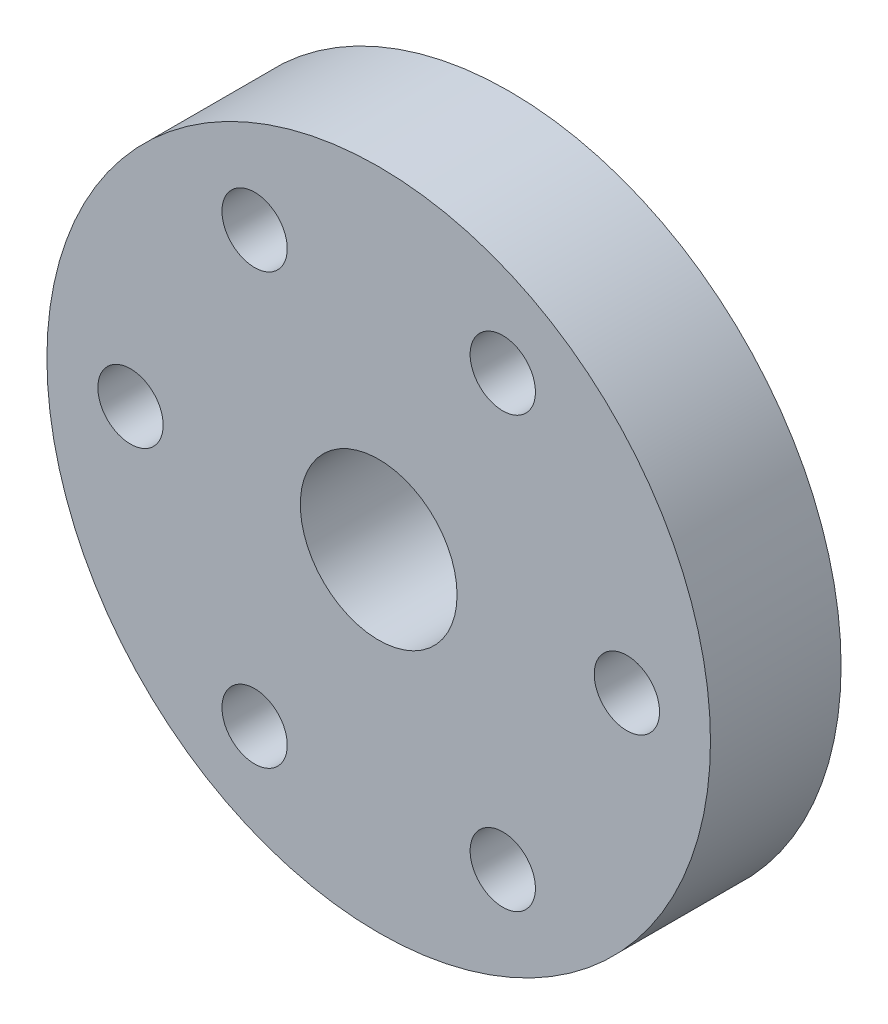
ISO-10303-21;
HEADER;
FILE_DESCRIPTION(('STEP AP214'),'2;1');
FILE_NAME('part.step','',(''),(''),'','','');
FILE_SCHEMA(('AUTOMOTIVE_DESIGN { 1 0 10303 214 1 1 1 1 }'));
ENDSEC;
DATA;
#1=APPLICATION_CONTEXT('core data for automotive mechanical design processes');
#2=APPLICATION_PROTOCOL_DEFINITION('international standard','automotive_design',2000,#1);
#3=PRODUCT_CONTEXT('',#1,'mechanical');
#4=PRODUCT('Part','Part','',(#3));
#5=PRODUCT_RELATED_PRODUCT_CATEGORY('part','',(#4));
#6=PRODUCT_DEFINITION_FORMATION('','',#4);
#7=PRODUCT_DEFINITION_CONTEXT('part definition',#1,'design');
#8=PRODUCT_DEFINITION('design','',#6,#7);
#9=PRODUCT_DEFINITION_SHAPE('','',#8);
#10=(LENGTH_UNIT() NAMED_UNIT(*) SI_UNIT(.MILLI.,.METRE.));
#11=(NAMED_UNIT(*) PLANE_ANGLE_UNIT() SI_UNIT($,.RADIAN.));
#12=(NAMED_UNIT(*) SI_UNIT($,.STERADIAN.) SOLID_ANGLE_UNIT());
#13=UNCERTAINTY_MEASURE_WITH_UNIT(LENGTH_MEASURE(1.E-05),#10,'distance_accuracy_value','');
#14=(GEOMETRIC_REPRESENTATION_CONTEXT(3) GLOBAL_UNCERTAINTY_ASSIGNED_CONTEXT((#13)) GLOBAL_UNIT_ASSIGNED_CONTEXT((#10,
#11,#12)) REPRESENTATION_CONTEXT('',''));
#15=CARTESIAN_POINT('',(0.,0.,0.));
#16=DIRECTION('',(0.,0.,1.));
#17=DIRECTION('',(1.,0.,0.));
#18=AXIS2_PLACEMENT_3D('',#15,#16,#17);
#19=CARTESIAN_POINT('',(0.,0.,50.2689914784627));
#20=DIRECTION('',(0.,0.,1.));
#21=DIRECTION('',(1.,0.,0.));
#22=AXIS2_PLACEMENT_3D('',#19,#20,#21);
#23=CYLINDRICAL_SURFACE('',#22,3.);
#24=CARTESIAN_POINT('',(0.,0.,-9.2));
#25=DIRECTION('',(0.,0.,1.));
#26=DIRECTION('',(1.,0.,0.));
#27=AXIS2_PLACEMENT_3D('',#24,#25,#26);
#28=CIRCLE('',#27,3.);
#29=CARTESIAN_POINT('',(3.,0.,-9.2));
#30=VERTEX_POINT('',#29);
#31=EDGE_CURVE('E49',#30,#30,#28,.T.);
#32=ORIENTED_EDGE('',*,*,#31,.F.);
#33=EDGE_LOOP('',(#32));
#34=FACE_BOUND('',#33,.T.);
#35=CARTESIAN_POINT('',(0.,0.,0.));
#36=DIRECTION('',(0.,0.,1.));
#37=DIRECTION('',(1.,0.,0.));
#38=AXIS2_PLACEMENT_3D('',#35,#36,#37);
#39=CIRCLE('',#38,3.);
#40=CARTESIAN_POINT('',(3.,0.,0.));
#41=VERTEX_POINT('',#40);
#42=EDGE_CURVE('E10',#41,#41,#39,.T.);
#43=ORIENTED_EDGE('',*,*,#42,.T.);
#44=EDGE_LOOP('',(#43));
#45=FACE_BOUND('',#44,.T.);
#46=ADVANCED_FACE('F30',(#34,#45),#23,.F.);
#47=CARTESIAN_POINT('',(0.,3.,0.));
#48=DIRECTION('',(0.,0.,-1.));
#49=DIRECTION('',(-1.,0.,0.));
#50=AXIS2_PLACEMENT_3D('',#47,#48,#49);
#51=PLANE('',#50);
#52=CARTESIAN_POINT('',(-4.74999999999992,8.22724133595221,0.));
#53=DIRECTION('',(0.,0.,1.));
#54=DIRECTION('',(1.,0.,0.));
#55=AXIS2_PLACEMENT_3D('',#52,#53,#54);
#56=CIRCLE('',#55,1.24999999999999);
#57=CARTESIAN_POINT('',(-3.49999999999993,8.22724133595221,0.));
#58=VERTEX_POINT('',#57);
#59=EDGE_CURVE('E74',#58,#58,#56,.T.);
#60=ORIENTED_EDGE('',*,*,#59,.F.);
#61=EDGE_LOOP('',(#60));
#62=FACE_BOUND('',#61,.T.);
#63=CARTESIAN_POINT('',(4.7500000000001,8.22724133595211,0.));
#64=DIRECTION('',(0.,0.,1.));
#65=DIRECTION('',(1.,0.,0.));
#66=AXIS2_PLACEMENT_3D('',#63,#64,#65);
#67=CIRCLE('',#66,1.24999999999999);
#68=CARTESIAN_POINT('',(6.00000000000009,8.22724133595211,0.));
#69=VERTEX_POINT('',#68);
#70=EDGE_CURVE('E64',#69,#69,#67,.T.);
#71=ORIENTED_EDGE('',*,*,#70,.F.);
#72=EDGE_LOOP('',(#71));
#73=FACE_BOUND('',#72,.T.);
#74=CARTESIAN_POINT('',(9.5,0.,0.));
#75=DIRECTION('',(0.,0.,1.));
#76=DIRECTION('',(1.,0.,0.));
#77=AXIS2_PLACEMENT_3D('',#74,#75,#76);
#78=CIRCLE('',#77,1.24999999999999);
#79=CARTESIAN_POINT('',(10.75,0.,0.));
#80=VERTEX_POINT('',#79);
#81=EDGE_CURVE('E61',#80,#80,#78,.T.);
#82=ORIENTED_EDGE('',*,*,#81,.F.);
#83=EDGE_LOOP('',(#82));
#84=FACE_BOUND('',#83,.T.);
#85=CARTESIAN_POINT('',(4.74999999999998,-8.22724133595218,0.));
#86=DIRECTION('',(0.,0.,1.));
#87=DIRECTION('',(1.,0.,0.));
#88=AXIS2_PLACEMENT_3D('',#85,#86,#87);
#89=CIRCLE('',#88,1.24999999999999);
#90=CARTESIAN_POINT('',(5.99999999999997,-8.22724133595218,0.));
#91=VERTEX_POINT('',#90);
#92=EDGE_CURVE('E58',#91,#91,#89,.T.);
#93=ORIENTED_EDGE('',*,*,#92,.F.);
#94=EDGE_LOOP('',(#93));
#95=FACE_BOUND('',#94,.T.);
#96=CARTESIAN_POINT('',(-4.75000000000004,-8.22724133595215,0.));
#97=DIRECTION('',(0.,0.,1.));
#98=DIRECTION('',(1.,0.,0.));
#99=AXIS2_PLACEMENT_3D('',#96,#97,#98);
#100=CIRCLE('',#99,1.24999999999999);
#101=CARTESIAN_POINT('',(-3.50000000000005,-8.22724133595215,0.));
#102=VERTEX_POINT('',#101);
#103=EDGE_CURVE('E54',#102,#102,#100,.T.);
#104=ORIENTED_EDGE('',*,*,#103,.F.);
#105=EDGE_LOOP('',(#104));
#106=FACE_BOUND('',#105,.T.);
#107=CARTESIAN_POINT('',(-9.5,0.,0.));
#108=DIRECTION('',(0.,0.,1.));
#109=DIRECTION('',(1.,0.,0.));
#110=AXIS2_PLACEMENT_3D('',#107,#108,#109);
#111=CIRCLE('',#110,1.24999999999999);
#112=CARTESIAN_POINT('',(-8.25000000000001,0.,0.));
#113=VERTEX_POINT('',#112);
#114=EDGE_CURVE('E50',#113,#113,#111,.T.);
#115=ORIENTED_EDGE('',*,*,#114,.F.);
#116=EDGE_LOOP('',(#115));
#117=FACE_BOUND('',#116,.T.);
#118=ORIENTED_EDGE('',*,*,#42,.F.);
#119=EDGE_LOOP('',(#118));
#120=FACE_BOUND('',#119,.T.);
#121=CARTESIAN_POINT('',(0.,0.,0.));
#122=DIRECTION('',(0.,0.,1.));
#123=DIRECTION('',(1.,0.,0.));
#124=AXIS2_PLACEMENT_3D('',#121,#122,#123);
#125=CIRCLE('',#124,12.7);
#126=CARTESIAN_POINT('',(12.7,0.,0.));
#127=VERTEX_POINT('',#126);
#128=EDGE_CURVE('E37',#127,#127,#125,.T.);
#129=ORIENTED_EDGE('',*,*,#128,.T.);
#130=EDGE_LOOP('',(#129));
#131=FACE_BOUND('',#130,.T.);
#132=ADVANCED_FACE('F116',(#62,#73,#84,#95,#106,#117,#120,#131),#51,.F.);
#133=CARTESIAN_POINT('',(0.,0.,50.2689914784627));
#134=DIRECTION('',(0.,0.,1.));
#135=DIRECTION('',(1.,0.,0.));
#136=AXIS2_PLACEMENT_3D('',#133,#134,#135);
#137=CYLINDRICAL_SURFACE('',#136,12.7);
#138=ORIENTED_EDGE('',*,*,#128,.F.);
#139=EDGE_LOOP('',(#138));
#140=FACE_BOUND('',#139,.T.);
#141=CARTESIAN_POINT('',(0.,0.,-5.));
#142=DIRECTION('',(0.,0.,1.));
#143=DIRECTION('',(1.,0.,0.));
#144=AXIS2_PLACEMENT_3D('',#141,#142,#143);
#145=CIRCLE('',#144,12.7);
#146=CARTESIAN_POINT('',(12.7,0.,-5.));
#147=VERTEX_POINT('',#146);
#148=EDGE_CURVE('E42',#147,#147,#145,.T.);
#149=ORIENTED_EDGE('',*,*,#148,.T.);
#150=EDGE_LOOP('',(#149));
#151=FACE_BOUND('',#150,.T.);
#152=ADVANCED_FACE('F93',(#140,#151),#137,.T.);
#153=CARTESIAN_POINT('',(0.,12.7,-5.));
#154=DIRECTION('',(0.,0.,1.));
#155=DIRECTION('',(1.,0.,0.));
#156=AXIS2_PLACEMENT_3D('',#153,#154,#155);
#157=PLANE('',#156);
#158=CARTESIAN_POINT('',(-4.74999999999992,8.22724133595221,-5.));
#159=DIRECTION('',(0.,0.,1.));
#160=DIRECTION('',(1.,0.,0.));
#161=AXIS2_PLACEMENT_3D('',#158,#159,#160);
#162=CIRCLE('',#161,1.24999999999999);
#163=CARTESIAN_POINT('',(-3.49999999999994,8.22724133595221,-5.));
#164=VERTEX_POINT('',#163);
#165=EDGE_CURVE('E33',#164,#164,#162,.T.);
#166=ORIENTED_EDGE('',*,*,#165,.T.);
#167=EDGE_LOOP('',(#166));
#168=FACE_BOUND('',#167,.T.);
#169=CARTESIAN_POINT('',(4.7500000000001,8.22724133595211,-5.));
#170=DIRECTION('',(0.,0.,1.));
#171=DIRECTION('',(1.,0.,0.));
#172=AXIS2_PLACEMENT_3D('',#169,#170,#171);
#173=CIRCLE('',#172,1.24999999999999);
#174=CARTESIAN_POINT('',(6.00000000000008,8.22724133595211,-5.));
#175=VERTEX_POINT('',#174);
#176=EDGE_CURVE('E62',#175,#175,#173,.T.);
#177=ORIENTED_EDGE('',*,*,#176,.T.);
#178=EDGE_LOOP('',(#177));
#179=FACE_BOUND('',#178,.T.);
#180=CARTESIAN_POINT('',(9.5,0.,-5.));
#181=DIRECTION('',(0.,0.,1.));
#182=DIRECTION('',(1.,0.,0.));
#183=AXIS2_PLACEMENT_3D('',#180,#181,#182);
#184=CIRCLE('',#183,1.24999999999999);
#185=CARTESIAN_POINT('',(10.75,0.,-5.));
#186=VERTEX_POINT('',#185);
#187=EDGE_CURVE('E59',#186,#186,#184,.T.);
#188=ORIENTED_EDGE('',*,*,#187,.T.);
#189=EDGE_LOOP('',(#188));
#190=FACE_BOUND('',#189,.T.);
#191=CARTESIAN_POINT('',(4.74999999999998,-8.22724133595218,-5.));
#192=DIRECTION('',(0.,0.,1.));
#193=DIRECTION('',(1.,0.,0.));
#194=AXIS2_PLACEMENT_3D('',#191,#192,#193);
#195=CIRCLE('',#194,1.24999999999999);
#196=CARTESIAN_POINT('',(5.99999999999997,-8.22724133595218,-5.));
#197=VERTEX_POINT('',#196);
#198=EDGE_CURVE('E55',#197,#197,#195,.T.);
#199=ORIENTED_EDGE('',*,*,#198,.T.);
#200=EDGE_LOOP('',(#199));
#201=FACE_BOUND('',#200,.T.);
#202=CARTESIAN_POINT('',(-4.75000000000004,-8.22724133595215,-5.));
#203=DIRECTION('',(0.,0.,1.));
#204=DIRECTION('',(1.,0.,0.));
#205=AXIS2_PLACEMENT_3D('',#202,#203,#204);
#206=CIRCLE('',#205,1.24999999999999);
#207=CARTESIAN_POINT('',(-3.50000000000005,-8.22724133595215,-5.));
#208=VERTEX_POINT('',#207);
#209=EDGE_CURVE('E51',#208,#208,#206,.T.);
#210=ORIENTED_EDGE('',*,*,#209,.T.);
#211=EDGE_LOOP('',(#210));
#212=FACE_BOUND('',#211,.T.);
#213=CARTESIAN_POINT('',(-9.5,0.,-5.));
#214=DIRECTION('',(0.,0.,1.));
#215=DIRECTION('',(1.,0.,0.));
#216=AXIS2_PLACEMENT_3D('',#213,#214,#215);
#217=CIRCLE('',#216,1.24999999999999);
#218=CARTESIAN_POINT('',(-8.25000000000001,0.,-5.));
#219=VERTEX_POINT('',#218);
#220=EDGE_CURVE('E46',#219,#219,#217,.T.);
#221=ORIENTED_EDGE('',*,*,#220,.T.);
#222=EDGE_LOOP('',(#221));
#223=FACE_BOUND('',#222,.T.);
#224=ORIENTED_EDGE('',*,*,#148,.F.);
#225=EDGE_LOOP('',(#224));
#226=FACE_BOUND('',#225,.T.);
#227=CARTESIAN_POINT('',(0.,0.,-5.));
#228=DIRECTION('',(0.,0.,1.));
#229=DIRECTION('',(1.,0.,0.));
#230=AXIS2_PLACEMENT_3D('',#227,#228,#229);
#231=CIRCLE('',#230,6.);
#232=CARTESIAN_POINT('',(6.,0.,-5.));
#233=VERTEX_POINT('',#232);
#234=EDGE_CURVE('E88',#233,#233,#231,.T.);
#235=ORIENTED_EDGE('',*,*,#234,.T.);
#236=EDGE_LOOP('',(#235));
#237=FACE_BOUND('',#236,.T.);
#238=ADVANCED_FACE('F95',(#168,#179,#190,#201,#212,#223,#226,#237),#157,.F.);
#239=CARTESIAN_POINT('',(0.,0.,50.2689914784627));
#240=DIRECTION('',(0.,0.,1.));
#241=DIRECTION('',(1.,0.,0.));
#242=AXIS2_PLACEMENT_3D('',#239,#240,#241);
#243=CYLINDRICAL_SURFACE('',#242,6.);
#244=ORIENTED_EDGE('',*,*,#234,.F.);
#245=EDGE_LOOP('',(#244));
#246=FACE_BOUND('',#245,.T.);
#247=CARTESIAN_POINT('',(0.,0.,-9.2));
#248=DIRECTION('',(0.,0.,1.));
#249=DIRECTION('',(1.,0.,0.));
#250=AXIS2_PLACEMENT_3D('',#247,#248,#249);
#251=CIRCLE('',#250,6.);
#252=CARTESIAN_POINT('',(6.,0.,-9.2));
#253=VERTEX_POINT('',#252);
#254=EDGE_CURVE('E85',#253,#253,#251,.T.);
#255=ORIENTED_EDGE('',*,*,#254,.T.);
#256=EDGE_LOOP('',(#255));
#257=FACE_BOUND('',#256,.T.);
#258=ADVANCED_FACE('F98',(#246,#257),#243,.T.);
#259=CARTESIAN_POINT('',(0.,6.,-9.2));
#260=DIRECTION('',(0.,0.,1.));
#261=DIRECTION('',(1.,0.,0.));
#262=AXIS2_PLACEMENT_3D('',#259,#260,#261);
#263=PLANE('',#262);
#264=ORIENTED_EDGE('',*,*,#254,.F.);
#265=EDGE_LOOP('',(#264));
#266=FACE_BOUND('',#265,.T.);
#267=ORIENTED_EDGE('',*,*,#31,.T.);
#268=EDGE_LOOP('',(#267));
#269=FACE_BOUND('',#268,.T.);
#270=ADVANCED_FACE('F105',(#266,#269),#263,.F.);
#271=CARTESIAN_POINT('',(-9.5,0.,0.));
#272=DIRECTION('',(0.,0.,1.));
#273=DIRECTION('',(1.,0.,0.));
#274=AXIS2_PLACEMENT_3D('',#271,#272,#273);
#275=CYLINDRICAL_SURFACE('',#274,1.24999999999999);
#276=ORIENTED_EDGE('',*,*,#114,.T.);
#277=EDGE_LOOP('',(#276));
#278=FACE_BOUND('',#277,.T.);
#279=ORIENTED_EDGE('',*,*,#220,.F.);
#280=EDGE_LOOP('',(#279));
#281=FACE_BOUND('',#280,.T.);
#282=ADVANCED_FACE('F111',(#278,#281),#275,.F.);
#283=CARTESIAN_POINT('',(-4.75000000000004,-8.22724133595215,0.));
#284=DIRECTION('',(0.,0.,1.));
#285=DIRECTION('',(1.,0.,0.));
#286=AXIS2_PLACEMENT_3D('',#283,#284,#285);
#287=CYLINDRICAL_SURFACE('',#286,1.24999999999999);
#288=ORIENTED_EDGE('',*,*,#103,.T.);
#289=EDGE_LOOP('',(#288));
#290=FACE_BOUND('',#289,.T.);
#291=ORIENTED_EDGE('',*,*,#209,.F.);
#292=EDGE_LOOP('',(#291));
#293=FACE_BOUND('',#292,.T.);
#294=ADVANCED_FACE('F131',(#290,#293),#287,.F.);
#295=CARTESIAN_POINT('',(4.74999999999998,-8.22724133595218,0.));
#296=DIRECTION('',(0.,0.,1.));
#297=DIRECTION('',(1.,0.,0.));
#298=AXIS2_PLACEMENT_3D('',#295,#296,#297);
#299=CYLINDRICAL_SURFACE('',#298,1.24999999999999);
#300=ORIENTED_EDGE('',*,*,#92,.T.);
#301=EDGE_LOOP('',(#300));
#302=FACE_BOUND('',#301,.T.);
#303=ORIENTED_EDGE('',*,*,#198,.F.);
#304=EDGE_LOOP('',(#303));
#305=FACE_BOUND('',#304,.T.);
#306=ADVANCED_FACE('F135',(#302,#305),#299,.F.);
#307=CARTESIAN_POINT('',(9.5,0.,0.));
#308=DIRECTION('',(0.,0.,1.));
#309=DIRECTION('',(1.,0.,0.));
#310=AXIS2_PLACEMENT_3D('',#307,#308,#309);
#311=CYLINDRICAL_SURFACE('',#310,1.24999999999999);
#312=ORIENTED_EDGE('',*,*,#81,.T.);
#313=EDGE_LOOP('',(#312));
#314=FACE_BOUND('',#313,.T.);
#315=ORIENTED_EDGE('',*,*,#187,.F.);
#316=EDGE_LOOP('',(#315));
#317=FACE_BOUND('',#316,.T.);
#318=ADVANCED_FACE('F139',(#314,#317),#311,.F.);
#319=CARTESIAN_POINT('',(4.7500000000001,8.22724133595211,0.));
#320=DIRECTION('',(0.,0.,1.));
#321=DIRECTION('',(1.,0.,0.));
#322=AXIS2_PLACEMENT_3D('',#319,#320,#321);
#323=CYLINDRICAL_SURFACE('',#322,1.24999999999999);
#324=ORIENTED_EDGE('',*,*,#70,.T.);
#325=EDGE_LOOP('',(#324));
#326=FACE_BOUND('',#325,.T.);
#327=ORIENTED_EDGE('',*,*,#176,.F.);
#328=EDGE_LOOP('',(#327));
#329=FACE_BOUND('',#328,.T.);
#330=ADVANCED_FACE('F143',(#326,#329),#323,.F.);
#331=CARTESIAN_POINT('',(-4.74999999999992,8.22724133595221,0.));
#332=DIRECTION('',(0.,0.,1.));
#333=DIRECTION('',(1.,0.,0.));
#334=AXIS2_PLACEMENT_3D('',#331,#332,#333);
#335=CYLINDRICAL_SURFACE('',#334,1.24999999999999);
#336=ORIENTED_EDGE('',*,*,#59,.T.);
#337=EDGE_LOOP('',(#336));
#338=FACE_BOUND('',#337,.T.);
#339=ORIENTED_EDGE('',*,*,#165,.F.);
#340=EDGE_LOOP('',(#339));
#341=FACE_BOUND('',#340,.T.);
#342=ADVANCED_FACE('F147',(#338,#341),#335,.F.);
#343=CLOSED_SHELL('',(#46,#132,#152,#238,#258,#270,#282,#294,#306,#318,#330,#342));
#344=MANIFOLD_SOLID_BREP('B2',#343);
#345=ADVANCED_BREP_SHAPE_REPRESENTATION('',(#18,#344),#14);
#346=SHAPE_DEFINITION_REPRESENTATION(#9,#345);
ENDSEC;
END-ISO-10303-21;
